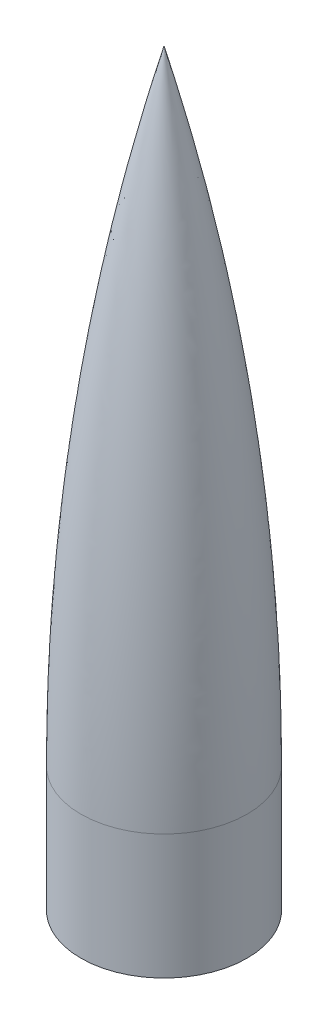
ISO-10303-21;
HEADER;
FILE_DESCRIPTION(('STEP AP214'),'2;1');
FILE_NAME('part.step','',(''),(''),'','','');
FILE_SCHEMA(('AUTOMOTIVE_DESIGN { 1 0 10303 214 1 1 1 1 }'));
ENDSEC;
DATA;
#1=APPLICATION_CONTEXT('core data for automotive mechanical design processes');
#2=APPLICATION_PROTOCOL_DEFINITION('international standard','automotive_design',2000,#1);
#3=PRODUCT_CONTEXT('',#1,'mechanical');
#4=PRODUCT('Part','Part','',(#3));
#5=PRODUCT_RELATED_PRODUCT_CATEGORY('part','',(#4));
#6=PRODUCT_DEFINITION_FORMATION('','',#4);
#7=PRODUCT_DEFINITION_CONTEXT('part definition',#1,'design');
#8=PRODUCT_DEFINITION('design','',#6,#7);
#9=PRODUCT_DEFINITION_SHAPE('','',#8);
#10=(LENGTH_UNIT() NAMED_UNIT(*) SI_UNIT(.MILLI.,.METRE.));
#11=(NAMED_UNIT(*) PLANE_ANGLE_UNIT() SI_UNIT($,.RADIAN.));
#12=(NAMED_UNIT(*) SI_UNIT($,.STERADIAN.) SOLID_ANGLE_UNIT());
#13=UNCERTAINTY_MEASURE_WITH_UNIT(LENGTH_MEASURE(1.E-05),#10,'distance_accuracy_value','');
#14=(GEOMETRIC_REPRESENTATION_CONTEXT(3) GLOBAL_UNCERTAINTY_ASSIGNED_CONTEXT((#13)) GLOBAL_UNIT_ASSIGNED_CONTEXT((#10,
#11,#12)) REPRESENTATION_CONTEXT('',''));
#15=CARTESIAN_POINT('',(0.,0.,0.));
#16=DIRECTION('',(0.,0.,1.));
#17=DIRECTION('',(1.,0.,0.));
#18=AXIS2_PLACEMENT_3D('',#15,#16,#17);
#19=CARTESIAN_POINT('',(0.,76.2,1403.35));
#20=DIRECTION('',(-1.,0.,0.));
#21=DIRECTION('',(0.,0.,-1.));
#22=AXIS2_PLACEMENT_3D('',#19,#20,#21);
#23=CIRCLE('',#22,1454.15);
#24=TRIMMED_CURVE('',#23,(PARAMETER_VALUE(-0.265103064593348)),
(PARAMETER_VALUE(0.265103064593348)),.T.,.PARAMETER.);
#25=CARTESIAN_POINT('',(0.,76.2,0.));
#26=DIRECTION('',(0.,-1.,0.));
#27=AXIS1_PLACEMENT('',#25,#26);
#28=SURFACE_OF_REVOLUTION('',#24,#27);
#29=CARTESIAN_POINT('',(0.,457.2,0.));
#30=VERTEX_POINT('',#29);
#31=VERTEX_LOOP('',#30);
#32=FACE_BOUND('',#31,.T.);
#33=CARTESIAN_POINT('',(0.,76.2,0.));
#34=DIRECTION('',(0.,-1.,0.));
#35=DIRECTION('',(0.,0.,-1.));
#36=AXIS2_PLACEMENT_3D('',#33,#34,#35);
#37=CIRCLE('',#36,50.8);
#38=CARTESIAN_POINT('',(0.,76.2,-50.8));
#39=VERTEX_POINT('',#38);
#40=EDGE_CURVE('E51',#39,#39,#37,.T.);
#41=ORIENTED_EDGE('',*,*,#40,.F.);
#42=EDGE_LOOP('',(#41));
#43=FACE_BOUND('',#42,.T.);
#44=ADVANCED_FACE('F33',(#32,#43),#28,.T.);
#45=CARTESIAN_POINT('',(0.,76.2,1403.35));
#46=DIRECTION('',(-1.,0.,0.));
#47=DIRECTION('',(0.,0.,-1.));
#48=AXIS2_PLACEMENT_3D('',#45,#46,#47);
#49=CIRCLE('',#48,1452.88);
#50=TRIMMED_CURVE('',#49,(PARAMETER_VALUE(-0.261864040542183)),
(PARAMETER_VALUE(0.261864040542183)),.T.,.PARAMETER.);
#51=CARTESIAN_POINT('',(0.,76.2,0.));
#52=DIRECTION('',(0.,-1.,0.));
#53=AXIS1_PLACEMENT('',#51,#52);
#54=SURFACE_OF_REVOLUTION('',#50,#53);
#55=CARTESIAN_POINT('',(0.,76.2,0.));
#56=DIRECTION('',(0.,-1.,0.));
#57=DIRECTION('',(0.,0.,-1.));
#58=AXIS2_PLACEMENT_3D('',#55,#56,#57);
#59=CIRCLE('',#58,49.5300000000001);
#60=CARTESIAN_POINT('',(0.,76.2,-49.5300000000001));
#61=VERTEX_POINT('',#60);
#62=EDGE_CURVE('E11',#61,#61,#59,.T.);
#63=ORIENTED_EDGE('',*,*,#62,.T.);
#64=EDGE_LOOP('',(#63));
#65=FACE_BOUND('',#64,.T.);
#66=CARTESIAN_POINT('',(0.,452.323745461516,0.));
#67=VERTEX_POINT('',#66);
#68=VERTEX_LOOP('',#67);
#69=FACE_BOUND('',#68,.T.);
#70=ADVANCED_FACE('F48',(#65,#69),#54,.F.);
#71=CARTESIAN_POINT('',(0.,0.,0.));
#72=DIRECTION('',(0.,-1.,0.));
#73=DIRECTION('',(0.,0.,-1.));
#74=AXIS2_PLACEMENT_3D('',#71,#72,#73);
#75=CYLINDRICAL_SURFACE('',#74,49.53);
#76=CARTESIAN_POINT('',(0.,0.,0.));
#77=DIRECTION('',(0.,-1.,0.));
#78=DIRECTION('',(0.,0.,-1.));
#79=AXIS2_PLACEMENT_3D('',#76,#77,#78);
#80=CIRCLE('',#79,49.53);
#81=CARTESIAN_POINT('',(0.,0.,-49.53));
#82=VERTEX_POINT('',#81);
#83=EDGE_CURVE('E40',#82,#82,#80,.T.);
#84=ORIENTED_EDGE('',*,*,#83,.T.);
#85=EDGE_LOOP('',(#84));
#86=FACE_BOUND('',#85,.T.);
#87=ORIENTED_EDGE('',*,*,#62,.F.);
#88=EDGE_LOOP('',(#87));
#89=FACE_BOUND('',#88,.T.);
#90=ADVANCED_FACE('F60',(#86,#89),#75,.F.);
#91=CARTESIAN_POINT('',(50.8,0.,0.));
#92=DIRECTION('',(0.,-1.,0.));
#93=DIRECTION('',(0.,0.,-1.));
#94=AXIS2_PLACEMENT_3D('',#91,#92,#93);
#95=PLANE('',#94);
#96=CARTESIAN_POINT('',(0.,0.,0.));
#97=DIRECTION('',(0.,-1.,0.));
#98=DIRECTION('',(0.,0.,-1.));
#99=AXIS2_PLACEMENT_3D('',#96,#97,#98);
#100=CIRCLE('',#99,50.8);
#101=CARTESIAN_POINT('',(0.,0.,-50.8));
#102=VERTEX_POINT('',#101);
#103=EDGE_CURVE('E53',#102,#102,#100,.T.);
#104=ORIENTED_EDGE('',*,*,#103,.T.);
#105=EDGE_LOOP('',(#104));
#106=FACE_BOUND('',#105,.T.);
#107=ORIENTED_EDGE('',*,*,#83,.F.);
#108=EDGE_LOOP('',(#107));
#109=FACE_BOUND('',#108,.T.);
#110=ADVANCED_FACE('F63',(#106,#109),#95,.T.);
#111=CARTESIAN_POINT('',(0.,0.,0.));
#112=DIRECTION('',(0.,-1.,0.));
#113=DIRECTION('',(0.,0.,-1.));
#114=AXIS2_PLACEMENT_3D('',#111,#112,#113);
#115=CYLINDRICAL_SURFACE('',#114,50.8);
#116=ORIENTED_EDGE('',*,*,#40,.T.);
#117=EDGE_LOOP('',(#116));
#118=FACE_BOUND('',#117,.T.);
#119=ORIENTED_EDGE('',*,*,#103,.F.);
#120=EDGE_LOOP('',(#119));
#121=FACE_BOUND('',#120,.T.);
#122=ADVANCED_FACE('F65',(#118,#121),#115,.T.);
#123=CLOSED_SHELL('',(#44,#70,#90,#110,#122));
#124=MANIFOLD_SOLID_BREP('B2',#123);
#125=ADVANCED_BREP_SHAPE_REPRESENTATION('',(#18,#124),#14);
#126=SHAPE_DEFINITION_REPRESENTATION(#9,#125);
ENDSEC;
END-ISO-10303-21;
